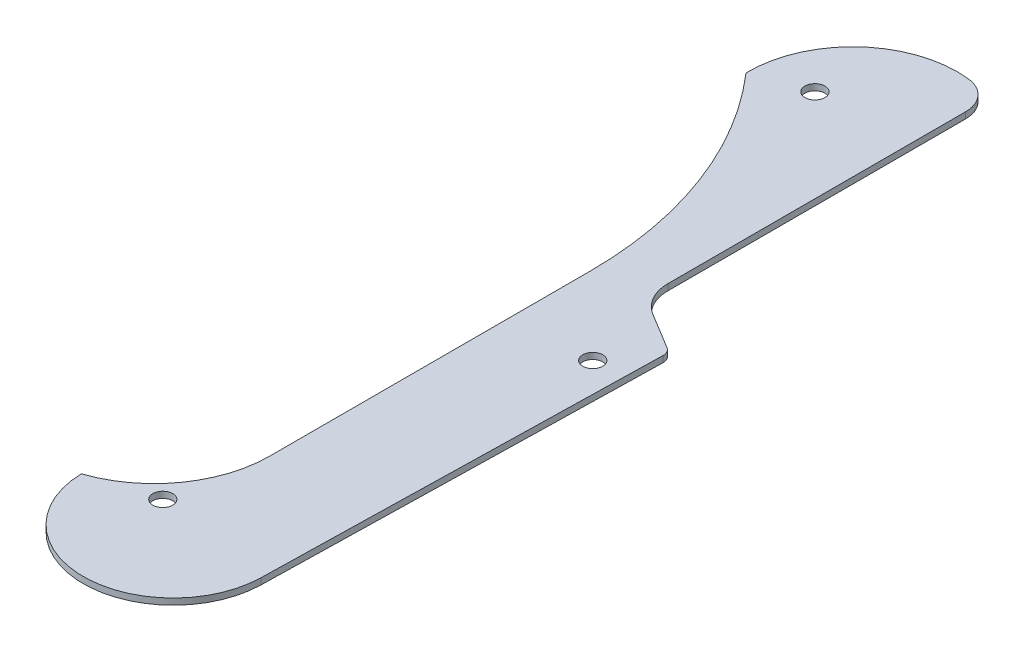
ISO-10303-21;
HEADER;
FILE_DESCRIPTION(('STEP AP214'),'2;1');
FILE_NAME('part.step','',(''),(''),'','','');
FILE_SCHEMA(('AUTOMOTIVE_DESIGN { 1 0 10303 214 1 1 1 1 }'));
ENDSEC;
DATA;
#1=APPLICATION_CONTEXT('core data for automotive mechanical design processes');
#2=APPLICATION_PROTOCOL_DEFINITION('international standard','automotive_design',2000,#1);
#3=PRODUCT_CONTEXT('',#1,'mechanical');
#4=PRODUCT('Part','Part','',(#3));
#5=PRODUCT_RELATED_PRODUCT_CATEGORY('part','',(#4));
#6=PRODUCT_DEFINITION_FORMATION('','',#4);
#7=PRODUCT_DEFINITION_CONTEXT('part definition',#1,'design');
#8=PRODUCT_DEFINITION('design','',#6,#7);
#9=PRODUCT_DEFINITION_SHAPE('','',#8);
#10=(LENGTH_UNIT() NAMED_UNIT(*) SI_UNIT(.MILLI.,.METRE.));
#11=(NAMED_UNIT(*) PLANE_ANGLE_UNIT() SI_UNIT($,.RADIAN.));
#12=(NAMED_UNIT(*) SI_UNIT($,.STERADIAN.) SOLID_ANGLE_UNIT());
#13=UNCERTAINTY_MEASURE_WITH_UNIT(LENGTH_MEASURE(1.E-05),#10,'distance_accuracy_value','');
#14=(GEOMETRIC_REPRESENTATION_CONTEXT(3) GLOBAL_UNCERTAINTY_ASSIGNED_CONTEXT((#13)) GLOBAL_UNIT_ASSIGNED_CONTEXT((#10,
#11,#12)) REPRESENTATION_CONTEXT('',''));
#15=CARTESIAN_POINT('',(0.,0.,0.));
#16=DIRECTION('',(0.,0.,1.));
#17=DIRECTION('',(1.,0.,0.));
#18=AXIS2_PLACEMENT_3D('',#15,#16,#17);
#19=CARTESIAN_POINT('',(0.869342172001299,0.625,-75.4327452585786));
#20=DIRECTION('',(0.,-1.,0.));
#21=DIRECTION('',(0.,0.,-1.));
#22=AXIS2_PLACEMENT_3D('',#19,#20,#21);
#23=CYLINDRICAL_SURFACE('',#22,3.);
#24=DIRECTION('',(0.,-1.,0.));
#25=VECTOR('',#24,1.);
#26=CARTESIAN_POINT('',(3.8693421720013,0.625,-75.4327452585786));
#27=LINE('',#26,#25);
#28=CARTESIAN_POINT('',(3.8693421720013,0.,-75.4327452585786));
#29=VERTEX_POINT('',#28);
#30=CARTESIAN_POINT('',(3.8693421720013,0.625,-75.4327452585786));
#31=VERTEX_POINT('',#30);
#32=EDGE_CURVE('E144',#29,#31,#27,.F.);
#33=ORIENTED_EDGE('',*,*,#32,.F.);
#34=CARTESIAN_POINT('',(0.869342172001299,0.,-75.4327452585786));
#35=DIRECTION('',(0.,-1.,0.));
#36=DIRECTION('',(0.,0.,-1.));
#37=AXIS2_PLACEMENT_3D('',#34,#35,#36);
#38=CIRCLE('',#37,3.);
#39=CARTESIAN_POINT('',(1.21784983835103,0.,-78.4124335655154));
#40=VERTEX_POINT('',#39);
#41=EDGE_CURVE('E45',#40,#29,#38,.T.);
#42=ORIENTED_EDGE('',*,*,#41,.F.);
#43=DIRECTION('',(0.,-1.,0.));
#44=VECTOR('',#43,1.);
#45=CARTESIAN_POINT('',(1.21784983835103,0.625,-78.4124335655154));
#46=LINE('',#45,#44);
#47=CARTESIAN_POINT('',(1.21784983835103,0.625,-78.4124335655154));
#48=VERTEX_POINT('',#47);
#49=EDGE_CURVE('E148',#48,#40,#46,.T.);
#50=ORIENTED_EDGE('',*,*,#49,.F.);
#51=CARTESIAN_POINT('',(0.869342172001299,0.625,-75.4327452585786));
#52=DIRECTION('',(0.,-1.,0.));
#53=DIRECTION('',(0.,0.,-1.));
#54=AXIS2_PLACEMENT_3D('',#51,#52,#53);
#55=CIRCLE('',#54,3.);
#56=EDGE_CURVE('E11',#31,#48,#55,.F.);
#57=ORIENTED_EDGE('',*,*,#56,.F.);
#58=EDGE_LOOP('',(#33,#42,#50,#57));
#59=FACE_BOUND('',#58,.T.);
#60=ADVANCED_FACE('F38',(#59),#23,.T.);
#61=CARTESIAN_POINT('',(0.,0.625,0.));
#62=DIRECTION('',(0.,-1.,0.));
#63=DIRECTION('',(0.,0.,-1.));
#64=AXIS2_PLACEMENT_3D('',#61,#62,#63);
#65=PLANE('',#64);
#66=CARTESIAN_POINT('',(-5.3990700013326,0.625,-69.6166137620408));
#67=DIRECTION('',(0.,-1.,0.));
#68=DIRECTION('',(0.,0.,-1.));
#69=AXIS2_PLACEMENT_3D('',#66,#67,#68);
#70=CIRCLE('',#69,0.999999999999998);
#71=CARTESIAN_POINT('',(-5.3990700013326,0.625,-70.6166137620408));
#72=VERTEX_POINT('',#71);
#73=EDGE_CURVE('E138',#72,#72,#70,.F.);
#74=ORIENTED_EDGE('',*,*,#73,.F.);
#75=EDGE_LOOP('',(#74));
#76=FACE_BOUND('',#75,.T.);
#77=CARTESIAN_POINT('',(6.76984482044387,0.625,-35.2160361829315));
#78=DIRECTION('',(0.,-1.,0.));
#79=DIRECTION('',(0.,0.,-1.));
#80=AXIS2_PLACEMENT_3D('',#77,#78,#79);
#81=CIRCLE('',#80,0.999999999999999);
#82=CARTESIAN_POINT('',(6.76984482044387,0.625,-36.2160361829315));
#83=VERTEX_POINT('',#82);
#84=EDGE_CURVE('E268',#83,#83,#81,.F.);
#85=ORIENTED_EDGE('',*,*,#84,.F.);
#86=EDGE_LOOP('',(#85));
#87=FACE_BOUND('',#86,.T.);
#88=CARTESIAN_POINT('',(-2.70506215575308,0.625,-1.67));
#89=DIRECTION('',(0.,-1.,0.));
#90=DIRECTION('',(0.,0.,-1.));
#91=AXIS2_PLACEMENT_3D('',#88,#89,#90);
#92=CIRCLE('',#91,1.);
#93=CARTESIAN_POINT('',(-2.70506215575308,0.625,-2.67));
#94=VERTEX_POINT('',#93);
#95=EDGE_CURVE('E218',#94,#94,#92,.F.);
#96=ORIENTED_EDGE('',*,*,#95,.F.);
#97=EDGE_LOOP('',(#96));
#98=FACE_BOUND('',#97,.T.);
#99=DIRECTION('',(0.,0.,-1.));
#100=VECTOR('',#99,1.);
#101=CARTESIAN_POINT('',(3.8693421720013,0.625,-45.6356836656231));
#102=LINE('',#101,#100);
#103=CARTESIAN_POINT('',(3.8693421720013,0.625,-45.6356836656231));
#104=VERTEX_POINT('',#103);
#105=EDGE_CURVE('E164',#104,#31,#102,.T.);
#106=ORIENTED_EDGE('',*,*,#105,.T.);
#107=ORIENTED_EDGE('',*,*,#56,.T.);
#108=CARTESIAN_POINT('',(0.,0.625,-68.));
#109=DIRECTION('',(0.,1.,0.));
#110=DIRECTION('',(0.,0.,1.));
#111=AXIS2_PLACEMENT_3D('',#108,#109,#110);
#112=CIRCLE('',#111,10.4834121823499);
#113=CARTESIAN_POINT('',(-10.4815735440394,0.625,-67.803666034689));
#114=VERTEX_POINT('',#113);
#115=EDGE_CURVE('E161',#48,#114,#112,.T.);
#116=ORIENTED_EDGE('',*,*,#115,.T.);
#117=CARTESIAN_POINT('',(-39.1042620139909,0.625,-42.8088324734886));
#118=DIRECTION('',(0.,1.,0.));
#119=DIRECTION('',(0.,0.,-1.));
#120=AXIS2_PLACEMENT_3D('',#117,#118,#119);
#121=CIRCLE('',#120,38.);
#122=CARTESIAN_POINT('',(-1.10426201399089,0.625,-42.8088324734886));
#123=VERTEX_POINT('',#122);
#124=EDGE_CURVE('E150',#123,#114,#121,.T.);
#125=ORIENTED_EDGE('',*,*,#124,.F.);
#126=DIRECTION('',(0.,0.,-1.));
#127=VECTOR('',#126,1.);
#128=CARTESIAN_POINT('',(-1.10426201399089,0.625,-42.8088324734886));
#129=LINE('',#128,#127);
#130=CARTESIAN_POINT('',(-1.10426201399088,0.625,-10.8088324734886));
#131=VERTEX_POINT('',#130);
#132=EDGE_CURVE('E143',#131,#123,#129,.T.);
#133=ORIENTED_EDGE('',*,*,#132,.F.);
#134=CARTESIAN_POINT('',(-12.7227021042548,0.625,-10.8088324734886));
#135=DIRECTION('',(0.,1.,0.));
#136=DIRECTION('',(0.,0.,-1.));
#137=AXIS2_PLACEMENT_3D('',#134,#135,#136);
#138=CIRCLE('',#137,11.6184400902639);
#139=CARTESIAN_POINT('',(-8.99785824371918,0.625,0.196333965311016));
#140=VERTEX_POINT('',#139);
#141=EDGE_CURVE('E121',#140,#131,#138,.T.);
#142=ORIENTED_EDGE('',*,*,#141,.F.);
#143=CARTESIAN_POINT('',(0.,0.625,0.));
#144=DIRECTION('',(0.,1.,0.));
#145=DIRECTION('',(0.,0.,-1.));
#146=AXIS2_PLACEMENT_3D('',#143,#144,#145);
#147=CIRCLE('',#146,9.);
#148=CARTESIAN_POINT('',(8.99785824371918,0.625,0.196333965311016));
#149=VERTEX_POINT('',#148);
#150=EDGE_CURVE('E133',#140,#149,#147,.T.);
#151=ORIENTED_EDGE('',*,*,#150,.T.);
#152=DIRECTION('',(0.0218148850345573,0.,-0.999762027079909));
#153=VECTOR('',#152,1.);
#154=CARTESIAN_POINT('',(8.99785824371918,0.625,0.196333965311016));
#155=LINE('',#154,#153);
#156=CARTESIAN_POINT('',(9.85674734225426,0.625,-39.1659961513962));
#157=VERTEX_POINT('',#156);
#158=EDGE_CURVE('E137',#149,#157,#155,.T.);
#159=ORIENTED_EDGE('',*,*,#158,.T.);
#160=CARTESIAN_POINT('',(8.85698531517435,0.625,-39.1878110364307));
#161=DIRECTION('',(0.,1.,0.));
#162=DIRECTION('',(0.,0.,1.));
#163=AXIS2_PLACEMENT_3D('',#160,#161,#162);
#164=CIRCLE('',#163,0.999999999999999);
#165=CARTESIAN_POINT('',(9.37575857333486,0.625,-40.0427229071037));
#166=VERTEX_POINT('',#165);
#167=EDGE_CURVE('E202',#157,#166,#164,.T.);
#168=ORIENTED_EDGE('',*,*,#167,.T.);
#169=DIRECTION('',(-0.85491187067295,0.,-0.518773258160516));
#170=VECTOR('',#169,1.);
#171=CARTESIAN_POINT('',(9.37575857333486,0.625,-40.0427229071037));
#172=LINE('',#171,#170);
#173=CARTESIAN_POINT('',(5.79424913935925,0.625,-42.2160361829313));
#174=VERTEX_POINT('',#173);
#175=EDGE_CURVE('E200',#166,#174,#172,.T.);
#176=ORIENTED_EDGE('',*,*,#175,.T.);
#177=CARTESIAN_POINT('',(7.8693421720013,0.625,-45.6356836656231));
#178=DIRECTION('',(0.,-1.,0.));
#179=DIRECTION('',(0.,0.,-1.));
#180=AXIS2_PLACEMENT_3D('',#177,#178,#179);
#181=CIRCLE('',#180,4.);
#182=EDGE_CURVE('E198',#174,#104,#181,.T.);
#183=ORIENTED_EDGE('',*,*,#182,.T.);
#184=EDGE_LOOP('',(#106,#107,#116,#125,#133,#142,#151,#159,#168,#176,#183));
#185=FACE_BOUND('',#184,.T.);
#186=ADVANCED_FACE('F140',(#76,#87,#98,#185),#65,.F.);
#187=CARTESIAN_POINT('',(0.,0.,0.));
#188=DIRECTION('',(0.,-1.,0.));
#189=DIRECTION('',(0.,0.,-1.));
#190=AXIS2_PLACEMENT_3D('',#187,#188,#189);
#191=PLANE('',#190);
#192=CARTESIAN_POINT('',(-5.3990700013326,0.,-69.6166137620408));
#193=DIRECTION('',(0.,-1.,0.));
#194=DIRECTION('',(0.,0.,-1.));
#195=AXIS2_PLACEMENT_3D('',#192,#193,#194);
#196=CIRCLE('',#195,0.999999999999998);
#197=CARTESIAN_POINT('',(-5.3990700013326,0.,-70.6166137620408));
#198=VERTEX_POINT('',#197);
#199=EDGE_CURVE('E280',#198,#198,#196,.T.);
#200=ORIENTED_EDGE('',*,*,#199,.F.);
#201=EDGE_LOOP('',(#200));
#202=FACE_BOUND('',#201,.T.);
#203=CARTESIAN_POINT('',(6.76984482044387,0.,-35.2160361829315));
#204=DIRECTION('',(0.,-1.,0.));
#205=DIRECTION('',(0.,0.,-1.));
#206=AXIS2_PLACEMENT_3D('',#203,#204,#205);
#207=CIRCLE('',#206,0.999999999999999);
#208=CARTESIAN_POINT('',(6.76984482044387,0.,-36.2160361829315));
#209=VERTEX_POINT('',#208);
#210=EDGE_CURVE('E272',#209,#209,#207,.T.);
#211=ORIENTED_EDGE('',*,*,#210,.F.);
#212=EDGE_LOOP('',(#211));
#213=FACE_BOUND('',#212,.T.);
#214=CARTESIAN_POINT('',(-2.70506215575308,0.,-1.67));
#215=DIRECTION('',(0.,-1.,0.));
#216=DIRECTION('',(0.,0.,-1.));
#217=AXIS2_PLACEMENT_3D('',#214,#215,#216);
#218=CIRCLE('',#217,1.);
#219=CARTESIAN_POINT('',(-2.70506215575308,0.,-2.67));
#220=VERTEX_POINT('',#219);
#221=EDGE_CURVE('E273',#220,#220,#218,.T.);
#222=ORIENTED_EDGE('',*,*,#221,.F.);
#223=EDGE_LOOP('',(#222));
#224=FACE_BOUND('',#223,.T.);
#225=CARTESIAN_POINT('',(0.,0.,-68.));
#226=DIRECTION('',(0.,1.,0.));
#227=DIRECTION('',(0.,0.,1.));
#228=AXIS2_PLACEMENT_3D('',#225,#226,#227);
#229=CIRCLE('',#228,10.4834121823499);
#230=CARTESIAN_POINT('',(-10.4815735440394,0.,-67.803666034689));
#231=VERTEX_POINT('',#230);
#232=EDGE_CURVE('E165',#40,#231,#229,.T.);
#233=ORIENTED_EDGE('',*,*,#232,.F.);
#234=ORIENTED_EDGE('',*,*,#41,.T.);
#235=DIRECTION('',(0.,0.,-1.));
#236=VECTOR('',#235,1.);
#237=CARTESIAN_POINT('',(3.8693421720013,0.,-45.6356836656231));
#238=LINE('',#237,#236);
#239=CARTESIAN_POINT('',(3.8693421720013,0.,-45.6356836656231));
#240=VERTEX_POINT('',#239);
#241=EDGE_CURVE('E175',#240,#29,#238,.T.);
#242=ORIENTED_EDGE('',*,*,#241,.F.);
#243=CARTESIAN_POINT('',(7.8693421720013,0.,-45.6356836656231));
#244=DIRECTION('',(0.,-1.,0.));
#245=DIRECTION('',(0.,0.,-1.));
#246=AXIS2_PLACEMENT_3D('',#243,#244,#245);
#247=CIRCLE('',#246,4.);
#248=CARTESIAN_POINT('',(5.79424913935925,0.,-42.2160361829313));
#249=VERTEX_POINT('',#248);
#250=EDGE_CURVE('E185',#249,#240,#247,.T.);
#251=ORIENTED_EDGE('',*,*,#250,.F.);
#252=DIRECTION('',(-0.85491187067295,0.,-0.518773258160516));
#253=VECTOR('',#252,1.);
#254=CARTESIAN_POINT('',(9.37575857333486,0.,-40.0427229071037));
#255=LINE('',#254,#253);
#256=CARTESIAN_POINT('',(9.37575857333486,0.,-40.0427229071037));
#257=VERTEX_POINT('',#256);
#258=EDGE_CURVE('E190',#257,#249,#255,.T.);
#259=ORIENTED_EDGE('',*,*,#258,.F.);
#260=CARTESIAN_POINT('',(8.85698531517435,0.,-39.1878110364307));
#261=DIRECTION('',(0.,1.,0.));
#262=DIRECTION('',(0.,0.,1.));
#263=AXIS2_PLACEMENT_3D('',#260,#261,#262);
#264=CIRCLE('',#263,0.999999999999999);
#265=CARTESIAN_POINT('',(9.85674734225426,0.,-39.1659961513962));
#266=VERTEX_POINT('',#265);
#267=EDGE_CURVE('E193',#266,#257,#264,.T.);
#268=ORIENTED_EDGE('',*,*,#267,.F.);
#269=DIRECTION('',(0.0218148850345573,0.,-0.999762027079909));
#270=VECTOR('',#269,1.);
#271=CARTESIAN_POINT('',(8.99785824371918,0.,0.196333965311016));
#272=LINE('',#271,#270);
#273=CARTESIAN_POINT('',(8.99785824371918,0.,0.196333965311016));
#274=VERTEX_POINT('',#273);
#275=EDGE_CURVE('E128',#274,#266,#272,.T.);
#276=ORIENTED_EDGE('',*,*,#275,.F.);
#277=CARTESIAN_POINT('',(0.,0.,0.));
#278=DIRECTION('',(0.,1.,0.));
#279=DIRECTION('',(0.,0.,-1.));
#280=AXIS2_PLACEMENT_3D('',#277,#278,#279);
#281=CIRCLE('',#280,9.);
#282=CARTESIAN_POINT('',(-8.99785824371918,0.,0.196333965311016));
#283=VERTEX_POINT('',#282);
#284=EDGE_CURVE('E129',#283,#274,#281,.T.);
#285=ORIENTED_EDGE('',*,*,#284,.F.);
#286=CARTESIAN_POINT('',(-12.7227021042548,0.,-10.8088324734886));
#287=DIRECTION('',(0.,1.,0.));
#288=DIRECTION('',(0.,0.,-1.));
#289=AXIS2_PLACEMENT_3D('',#286,#287,#288);
#290=CIRCLE('',#289,11.6184400902639);
#291=CARTESIAN_POINT('',(-1.10426201399088,0.,-10.8088324734886));
#292=VERTEX_POINT('',#291);
#293=EDGE_CURVE('E124',#283,#292,#290,.T.);
#294=ORIENTED_EDGE('',*,*,#293,.T.);
#295=DIRECTION('',(0.,0.,-1.));
#296=VECTOR('',#295,1.);
#297=CARTESIAN_POINT('',(-1.10426201399089,0.,-42.8088324734886));
#298=LINE('',#297,#296);
#299=CARTESIAN_POINT('',(-1.10426201399089,0.,-42.8088324734886));
#300=VERTEX_POINT('',#299);
#301=EDGE_CURVE('E158',#292,#300,#298,.T.);
#302=ORIENTED_EDGE('',*,*,#301,.T.);
#303=CARTESIAN_POINT('',(-39.1042620139909,0.,-42.8088324734886));
#304=DIRECTION('',(0.,1.,0.));
#305=DIRECTION('',(0.,0.,-1.));
#306=AXIS2_PLACEMENT_3D('',#303,#304,#305);
#307=CIRCLE('',#306,38.);
#308=EDGE_CURVE('E155',#300,#231,#307,.T.);
#309=ORIENTED_EDGE('',*,*,#308,.T.);
#310=EDGE_LOOP('',(#233,#234,#242,#251,#259,#268,#276,#285,#294,#302,#309));
#311=FACE_BOUND('',#310,.T.);
#312=ADVANCED_FACE('F172',(#202,#213,#224,#311),#191,.T.);
#313=CARTESIAN_POINT('',(0.,0.625,0.));
#314=DIRECTION('',(0.,-1.,0.));
#315=DIRECTION('',(0.,0.,-1.));
#316=AXIS2_PLACEMENT_3D('',#313,#314,#315);
#317=CYLINDRICAL_SURFACE('',#316,9.);
#318=ORIENTED_EDGE('',*,*,#284,.T.);
#319=DIRECTION('',(0.,-1.,0.));
#320=VECTOR('',#319,1.);
#321=CARTESIAN_POINT('',(8.99785824371918,0.625,0.196333965311016));
#322=LINE('',#321,#320);
#323=EDGE_CURVE('E136',#149,#274,#322,.T.);
#324=ORIENTED_EDGE('',*,*,#323,.F.);
#325=ORIENTED_EDGE('',*,*,#150,.F.);
#326=DIRECTION('',(0.,-1.,0.));
#327=VECTOR('',#326,1.);
#328=CARTESIAN_POINT('',(-8.99785824371918,0.625,0.196333965311016));
#329=LINE('',#328,#327);
#330=EDGE_CURVE('E117',#140,#283,#329,.T.);
#331=ORIENTED_EDGE('',*,*,#330,.T.);
#332=EDGE_LOOP('',(#318,#324,#325,#331));
#333=FACE_BOUND('',#332,.T.);
#334=ADVANCED_FACE('F134',(#333),#317,.T.);
#335=CARTESIAN_POINT('',(8.99785824371918,0.625,0.196333965311016));
#336=DIRECTION('',(-0.999762027079909,0.,-0.0218148850345573));
#337=DIRECTION('',(-0.0218148850345573,0.,0.999762027079909));
#338=AXIS2_PLACEMENT_3D('',#335,#336,#337);
#339=PLANE('',#338);
#340=ORIENTED_EDGE('',*,*,#275,.T.);
#341=DIRECTION('',(0.,-1.,0.));
#342=VECTOR('',#341,1.);
#343=CARTESIAN_POINT('',(9.85674734225426,0.625,-39.1659961513962));
#344=LINE('',#343,#342);
#345=EDGE_CURVE('E192',#157,#266,#344,.T.);
#346=ORIENTED_EDGE('',*,*,#345,.F.);
#347=ORIENTED_EDGE('',*,*,#158,.F.);
#348=ORIENTED_EDGE('',*,*,#323,.T.);
#349=EDGE_LOOP('',(#340,#346,#347,#348));
#350=FACE_BOUND('',#349,.T.);
#351=ADVANCED_FACE('F239',(#350),#339,.F.);
#352=CARTESIAN_POINT('',(8.85698531517435,0.625,-39.1878110364307));
#353=DIRECTION('',(0.,-1.,0.));
#354=DIRECTION('',(0.,0.,-1.));
#355=AXIS2_PLACEMENT_3D('',#352,#353,#354);
#356=CYLINDRICAL_SURFACE('',#355,0.999999999999999);
#357=ORIENTED_EDGE('',*,*,#267,.T.);
#358=DIRECTION('',(0.,-1.,0.));
#359=VECTOR('',#358,1.);
#360=CARTESIAN_POINT('',(9.37575857333486,0.625,-40.0427229071037));
#361=LINE('',#360,#359);
#362=EDGE_CURVE('E189',#166,#257,#361,.T.);
#363=ORIENTED_EDGE('',*,*,#362,.F.);
#364=ORIENTED_EDGE('',*,*,#167,.F.);
#365=ORIENTED_EDGE('',*,*,#345,.T.);
#366=EDGE_LOOP('',(#357,#363,#364,#365));
#367=FACE_BOUND('',#366,.T.);
#368=ADVANCED_FACE('F237',(#367),#356,.T.);
#369=CARTESIAN_POINT('',(9.37575857333486,0.625,-40.0427229071037));
#370=DIRECTION('',(-0.518773258160516,0.,0.85491187067295));
#371=DIRECTION('',(0.85491187067295,0.,0.518773258160516));
#372=AXIS2_PLACEMENT_3D('',#369,#370,#371);
#373=PLANE('',#372);
#374=ORIENTED_EDGE('',*,*,#258,.T.);
#375=DIRECTION('',(0.,-1.,0.));
#376=VECTOR('',#375,1.);
#377=CARTESIAN_POINT('',(5.79424913935925,0.625,-42.2160361829313));
#378=LINE('',#377,#376);
#379=EDGE_CURVE('E181',#174,#249,#378,.T.);
#380=ORIENTED_EDGE('',*,*,#379,.F.);
#381=ORIENTED_EDGE('',*,*,#175,.F.);
#382=ORIENTED_EDGE('',*,*,#362,.T.);
#383=EDGE_LOOP('',(#374,#380,#381,#382));
#384=FACE_BOUND('',#383,.T.);
#385=ADVANCED_FACE('F228',(#384),#373,.F.);
#386=CARTESIAN_POINT('',(7.8693421720013,0.625,-45.6356836656231));
#387=DIRECTION('',(0.,-1.,0.));
#388=DIRECTION('',(0.,0.,-1.));
#389=AXIS2_PLACEMENT_3D('',#386,#387,#388);
#390=CYLINDRICAL_SURFACE('',#389,4.);
#391=ORIENTED_EDGE('',*,*,#250,.T.);
#392=DIRECTION('',(0.,-1.,0.));
#393=VECTOR('',#392,1.);
#394=CARTESIAN_POINT('',(3.8693421720013,0.625,-45.6356836656231));
#395=LINE('',#394,#393);
#396=EDGE_CURVE('E167',#104,#240,#395,.T.);
#397=ORIENTED_EDGE('',*,*,#396,.F.);
#398=ORIENTED_EDGE('',*,*,#182,.F.);
#399=ORIENTED_EDGE('',*,*,#379,.T.);
#400=EDGE_LOOP('',(#391,#397,#398,#399));
#401=FACE_BOUND('',#400,.T.);
#402=ADVANCED_FACE('F234',(#401),#390,.F.);
#403=CARTESIAN_POINT('',(3.8693421720013,0.625,-45.6356836656231));
#404=DIRECTION('',(-1.,0.,0.));
#405=DIRECTION('',(0.,0.,1.));
#406=AXIS2_PLACEMENT_3D('',#403,#404,#405);
#407=PLANE('',#406);
#408=ORIENTED_EDGE('',*,*,#241,.T.);
#409=ORIENTED_EDGE('',*,*,#32,.T.);
#410=ORIENTED_EDGE('',*,*,#105,.F.);
#411=ORIENTED_EDGE('',*,*,#396,.T.);
#412=EDGE_LOOP('',(#408,#409,#410,#411));
#413=FACE_BOUND('',#412,.T.);
#414=ADVANCED_FACE('F179',(#413),#407,.F.);
#415=CARTESIAN_POINT('',(0.,0.625,-68.));
#416=DIRECTION('',(0.,-1.,0.));
#417=DIRECTION('',(0.,0.,-1.));
#418=AXIS2_PLACEMENT_3D('',#415,#416,#417);
#419=CYLINDRICAL_SURFACE('',#418,10.4834121823499);
#420=ORIENTED_EDGE('',*,*,#115,.F.);
#421=ORIENTED_EDGE('',*,*,#49,.T.);
#422=ORIENTED_EDGE('',*,*,#232,.T.);
#423=DIRECTION('',(0.,1.,0.));
#424=VECTOR('',#423,1.);
#425=CARTESIAN_POINT('',(-10.4815735440394,0.3125,-67.803666034689));
#426=LINE('',#425,#424);
#427=EDGE_CURVE('E166',#231,#114,#426,.T.);
#428=ORIENTED_EDGE('',*,*,#427,.T.);
#429=EDGE_LOOP('',(#420,#421,#422,#428));
#430=FACE_BOUND('',#429,.T.);
#431=ADVANCED_FACE('F214',(#430),#419,.T.);
#432=CARTESIAN_POINT('',(-1.10426201399089,0.,-42.8088324734886));
#433=DIRECTION('',(1.,0.,0.));
#434=DIRECTION('',(0.,0.,-1.));
#435=AXIS2_PLACEMENT_3D('',#432,#433,#434);
#436=PLANE('',#435);
#437=ORIENTED_EDGE('',*,*,#132,.T.);
#438=DIRECTION('',(0.,1.,0.));
#439=VECTOR('',#438,1.);
#440=CARTESIAN_POINT('',(-1.10426201399089,0.,-42.8088324734886));
#441=LINE('',#440,#439);
#442=EDGE_CURVE('E145',#300,#123,#441,.T.);
#443=ORIENTED_EDGE('',*,*,#442,.F.);
#444=ORIENTED_EDGE('',*,*,#301,.F.);
#445=DIRECTION('',(0.,1.,0.));
#446=VECTOR('',#445,1.);
#447=CARTESIAN_POINT('',(-1.10426201399088,0.,-10.8088324734886));
#448=LINE('',#447,#446);
#449=EDGE_CURVE('E205',#292,#131,#448,.T.);
#450=ORIENTED_EDGE('',*,*,#449,.T.);
#451=EDGE_LOOP('',(#437,#443,#444,#450));
#452=FACE_BOUND('',#451,.T.);
#453=ADVANCED_FACE('F242',(#452),#436,.F.);
#454=CARTESIAN_POINT('',(-39.1042620139909,0.,-42.8088324734886));
#455=DIRECTION('',(0.,1.,0.));
#456=DIRECTION('',(0.,0.,1.));
#457=AXIS2_PLACEMENT_3D('',#454,#455,#456);
#458=CYLINDRICAL_SURFACE('',#457,38.);
#459=ORIENTED_EDGE('',*,*,#124,.T.);
#460=ORIENTED_EDGE('',*,*,#427,.F.);
#461=ORIENTED_EDGE('',*,*,#308,.F.);
#462=ORIENTED_EDGE('',*,*,#442,.T.);
#463=EDGE_LOOP('',(#459,#460,#461,#462));
#464=FACE_BOUND('',#463,.T.);
#465=ADVANCED_FACE('F210',(#464),#458,.F.);
#466=CARTESIAN_POINT('',(-12.7227021042548,0.,-10.8088324734886));
#467=DIRECTION('',(0.,1.,0.));
#468=DIRECTION('',(0.,0.,1.));
#469=AXIS2_PLACEMENT_3D('',#466,#467,#468);
#470=CYLINDRICAL_SURFACE('',#469,11.6184400902639);
#471=ORIENTED_EDGE('',*,*,#141,.T.);
#472=ORIENTED_EDGE('',*,*,#449,.F.);
#473=ORIENTED_EDGE('',*,*,#293,.F.);
#474=ORIENTED_EDGE('',*,*,#330,.F.);
#475=EDGE_LOOP('',(#471,#472,#473,#474));
#476=FACE_BOUND('',#475,.T.);
#477=ADVANCED_FACE('F119',(#476),#470,.F.);
#478=CARTESIAN_POINT('',(-2.70506215575308,0.626,-1.67));
#479=DIRECTION('',(0.,-1.,0.));
#480=DIRECTION('',(0.,0.,-1.));
#481=AXIS2_PLACEMENT_3D('',#478,#479,#480);
#482=CYLINDRICAL_SURFACE('',#481,1.);
#483=CARTESIAN_POINT('',(-2.70506215575308,0.,-2.67));
#484=CARTESIAN_POINT('',(-2.70506215575308,0.00651041666666678,-2.67));
#485=CARTESIAN_POINT('',(-2.70506215575308,0.0130208333333335,-2.67));
#486=CARTESIAN_POINT('',(-2.70506215575308,0.0260416666666668,-2.67));
#487=CARTESIAN_POINT('',(-2.70506215575308,0.0325520833333335,-2.67));
#488=CARTESIAN_POINT('',(-2.70506215575308,0.0455729166666668,-2.67));
#489=CARTESIAN_POINT('',(-2.70506215575308,0.0520833333333335,-2.67));
#490=CARTESIAN_POINT('',(-2.70506215575308,0.0651041666666668,-2.67));
#491=CARTESIAN_POINT('',(-2.70506215575308,0.0716145833333334,-2.67));
#492=CARTESIAN_POINT('',(-2.70506215575308,0.0846354166666667,-2.67));
#493=CARTESIAN_POINT('',(-2.70506215575308,0.0911458333333334,-2.67));
#494=CARTESIAN_POINT('',(-2.70506215575308,0.104166666666667,-2.67));
#495=CARTESIAN_POINT('',(-2.70506215575308,0.110677083333333,-2.67));
#496=CARTESIAN_POINT('',(-2.70506215575308,0.123697916666667,-2.67));
#497=CARTESIAN_POINT('',(-2.70506215575308,0.130208333333333,-2.67));
#498=CARTESIAN_POINT('',(-2.70506215575308,0.143229166666667,-2.67));
#499=CARTESIAN_POINT('',(-2.70506215575308,0.149739583333333,-2.67));
#500=CARTESIAN_POINT('',(-2.70506215575308,0.162760416666667,-2.67));
#501=CARTESIAN_POINT('',(-2.70506215575308,0.169270833333333,-2.67));
#502=CARTESIAN_POINT('',(-2.70506215575308,0.182291666666667,-2.67));
#503=CARTESIAN_POINT('',(-2.70506215575308,0.188802083333333,-2.67));
#504=CARTESIAN_POINT('',(-2.70506215575308,0.201822916666667,-2.67));
#505=CARTESIAN_POINT('',(-2.70506215575308,0.208333333333333,-2.67));
#506=CARTESIAN_POINT('',(-2.70506215575308,0.221354166666667,-2.67));
#507=CARTESIAN_POINT('',(-2.70506215575308,0.227864583333333,-2.67));
#508=CARTESIAN_POINT('',(-2.70506215575308,0.240885416666667,-2.67));
#509=CARTESIAN_POINT('',(-2.70506215575308,0.247395833333333,-2.67));
#510=CARTESIAN_POINT('',(-2.70506215575308,0.260416666666667,-2.67));
#511=CARTESIAN_POINT('',(-2.70506215575308,0.266927083333333,-2.67));
#512=CARTESIAN_POINT('',(-2.70506215575308,0.279947916666667,-2.67));
#513=CARTESIAN_POINT('',(-2.70506215575308,0.286458333333333,-2.67));
#514=CARTESIAN_POINT('',(-2.70506215575308,0.299479166666667,-2.67));
#515=CARTESIAN_POINT('',(-2.70506215575308,0.305989583333333,-2.67));
#516=CARTESIAN_POINT('',(-2.70506215575308,0.319010416666667,-2.67));
#517=CARTESIAN_POINT('',(-2.70506215575308,0.325520833333333,-2.67));
#518=CARTESIAN_POINT('',(-2.70506215575308,0.338541666666667,-2.67));
#519=CARTESIAN_POINT('',(-2.70506215575308,0.345052083333333,-2.67));
#520=CARTESIAN_POINT('',(-2.70506215575308,0.358072916666667,-2.67));
#521=CARTESIAN_POINT('',(-2.70506215575308,0.364583333333333,-2.67));
#522=CARTESIAN_POINT('',(-2.70506215575308,0.377604166666667,-2.67));
#523=CARTESIAN_POINT('',(-2.70506215575308,0.384114583333333,-2.67));
#524=CARTESIAN_POINT('',(-2.70506215575308,0.397135416666667,-2.67));
#525=CARTESIAN_POINT('',(-2.70506215575308,0.403645833333333,-2.67));
#526=CARTESIAN_POINT('',(-2.70506215575308,0.416666666666667,-2.67));
#527=CARTESIAN_POINT('',(-2.70506215575308,0.423177083333333,-2.67));
#528=CARTESIAN_POINT('',(-2.70506215575308,0.436197916666667,-2.67));
#529=CARTESIAN_POINT('',(-2.70506215575308,0.442708333333333,-2.67));
#530=CARTESIAN_POINT('',(-2.70506215575308,0.455729166666667,-2.67));
#531=CARTESIAN_POINT('',(-2.70506215575308,0.462239583333333,-2.67));
#532=CARTESIAN_POINT('',(-2.70506215575308,0.475260416666667,-2.67));
#533=CARTESIAN_POINT('',(-2.70506215575308,0.481770833333333,-2.67));
#534=CARTESIAN_POINT('',(-2.70506215575308,0.494791666666667,-2.67));
#535=CARTESIAN_POINT('',(-2.70506215575308,0.501302083333333,-2.67));
#536=CARTESIAN_POINT('',(-2.70506215575308,0.514322916666667,-2.67));
#537=CARTESIAN_POINT('',(-2.70506215575308,0.520833333333333,-2.67));
#538=CARTESIAN_POINT('',(-2.70506215575308,0.533854166666667,-2.67));
#539=CARTESIAN_POINT('',(-2.70506215575308,0.540364583333333,-2.67));
#540=CARTESIAN_POINT('',(-2.70506215575308,0.553385416666667,-2.67));
#541=CARTESIAN_POINT('',(-2.70506215575308,0.559895833333333,-2.67));
#542=CARTESIAN_POINT('',(-2.70506215575308,0.572916666666667,-2.67));
#543=CARTESIAN_POINT('',(-2.70506215575308,0.579427083333333,-2.67));
#544=CARTESIAN_POINT('',(-2.70506215575308,0.592447916666667,-2.67));
#545=CARTESIAN_POINT('',(-2.70506215575308,0.598958333333333,-2.67));
#546=CARTESIAN_POINT('',(-2.70506215575308,0.611979166666667,-2.67));
#547=CARTESIAN_POINT('',(-2.70506215575308,0.618489583333333,-2.67));
#548=CARTESIAN_POINT('',(-2.70506215575308,0.625,-2.67));
#549=B_SPLINE_CURVE_WITH_KNOTS('',3,(#483,#484,#485,#486,#487,#488,#489,#490,#491,#492,#493,
#494,#495,#496,#497,#498,#499,#500,#501,#502,#503,#504,#505,#506,#507,#508,#509,#510,#511,#512,
#513,#514,#515,#516,#517,#518,#519,#520,#521,#522,#523,#524,#525,#526,#527,#528,#529,#530,#531,
#532,#533,#534,#535,#536,#537,#538,#539,#540,#541,#542,#543,#544,#545,#546,#547,#548),
.UNSPECIFIED.,.F.,.F.,(4,2,2,2,2,2,2,2,2,2,2,2,2,2,2,2,2,2,2,2,2,2,2,2,2,2,2,2,2,2,2,2,4),(0.,
0.01953125,0.0390625,0.0585937500000001,0.078125,0.09765625,0.1171875,0.13671875,0.15625,
0.17578125,0.1953125,0.21484375,0.234375,0.25390625,0.2734375,0.29296875,0.3125,0.33203125,
0.3515625,0.37109375,0.390625,0.41015625,0.4296875,0.44921875,0.46875,0.48828125,0.5078125,
0.52734375,0.546875,0.56640625,0.5859375,0.60546875,0.625),.UNSPECIFIED.);
#550=EDGE_CURVE('BSEAM295',#220,#94,#549,.T.);
#551=ORIENTED_EDGE('',*,*,#221,.T.);
#552=ORIENTED_EDGE('',*,*,#95,.T.);
#553=ORIENTED_EDGE('',*,*,#550,.T.);
#554=ORIENTED_EDGE('',*,*,#550,.F.);
#555=EDGE_LOOP('',(#551,#553,#552,#554));
#556=FACE_BOUND('',#555,.T.);
#557=ADVANCED_FACE('F295',(#556),#482,.F.);
#558=CARTESIAN_POINT('',(6.76984482044387,0.626,-35.2160361829315));
#559=DIRECTION('',(0.,-1.,0.));
#560=DIRECTION('',(0.,0.,-1.));
#561=AXIS2_PLACEMENT_3D('',#558,#559,#560);
#562=CYLINDRICAL_SURFACE('',#561,0.999999999999999);
#563=CARTESIAN_POINT('',(6.76984482044387,0.,-36.2160361829315));
#564=CARTESIAN_POINT('',(6.76984482044387,0.00651041666666678,-36.2160361829315));
#565=CARTESIAN_POINT('',(6.76984482044387,0.0130208333333335,-36.2160361829315));
#566=CARTESIAN_POINT('',(6.76984482044387,0.0260416666666668,-36.2160361829315));
#567=CARTESIAN_POINT('',(6.76984482044387,0.0325520833333335,-36.2160361829315));
#568=CARTESIAN_POINT('',(6.76984482044387,0.0455729166666668,-36.2160361829315));
#569=CARTESIAN_POINT('',(6.76984482044387,0.0520833333333335,-36.2160361829315));
#570=CARTESIAN_POINT('',(6.76984482044387,0.0651041666666668,-36.2160361829315));
#571=CARTESIAN_POINT('',(6.76984482044387,0.0716145833333334,-36.2160361829315));
#572=CARTESIAN_POINT('',(6.76984482044387,0.0846354166666667,-36.2160361829315));
#573=CARTESIAN_POINT('',(6.76984482044387,0.0911458333333334,-36.2160361829315));
#574=CARTESIAN_POINT('',(6.76984482044387,0.104166666666667,-36.2160361829315));
#575=CARTESIAN_POINT('',(6.76984482044387,0.110677083333333,-36.2160361829315));
#576=CARTESIAN_POINT('',(6.76984482044387,0.123697916666667,-36.2160361829315));
#577=CARTESIAN_POINT('',(6.76984482044387,0.130208333333333,-36.2160361829315));
#578=CARTESIAN_POINT('',(6.76984482044387,0.143229166666667,-36.2160361829315));
#579=CARTESIAN_POINT('',(6.76984482044387,0.149739583333333,-36.2160361829315));
#580=CARTESIAN_POINT('',(6.76984482044387,0.162760416666667,-36.2160361829315));
#581=CARTESIAN_POINT('',(6.76984482044387,0.169270833333333,-36.2160361829315));
#582=CARTESIAN_POINT('',(6.76984482044387,0.182291666666667,-36.2160361829315));
#583=CARTESIAN_POINT('',(6.76984482044387,0.188802083333333,-36.2160361829315));
#584=CARTESIAN_POINT('',(6.76984482044387,0.201822916666667,-36.2160361829315));
#585=CARTESIAN_POINT('',(6.76984482044387,0.208333333333333,-36.2160361829315));
#586=CARTESIAN_POINT('',(6.76984482044387,0.221354166666667,-36.2160361829315));
#587=CARTESIAN_POINT('',(6.76984482044387,0.227864583333333,-36.2160361829315));
#588=CARTESIAN_POINT('',(6.76984482044387,0.240885416666667,-36.2160361829315));
#589=CARTESIAN_POINT('',(6.76984482044387,0.247395833333333,-36.2160361829315));
#590=CARTESIAN_POINT('',(6.76984482044387,0.260416666666667,-36.2160361829315));
#591=CARTESIAN_POINT('',(6.76984482044387,0.266927083333333,-36.2160361829315));
#592=CARTESIAN_POINT('',(6.76984482044387,0.279947916666667,-36.2160361829315));
#593=CARTESIAN_POINT('',(6.76984482044387,0.286458333333333,-36.2160361829315));
#594=CARTESIAN_POINT('',(6.76984482044387,0.299479166666667,-36.2160361829315));
#595=CARTESIAN_POINT('',(6.76984482044387,0.305989583333333,-36.2160361829315));
#596=CARTESIAN_POINT('',(6.76984482044387,0.319010416666667,-36.2160361829315));
#597=CARTESIAN_POINT('',(6.76984482044387,0.325520833333333,-36.2160361829315));
#598=CARTESIAN_POINT('',(6.76984482044387,0.338541666666667,-36.2160361829315));
#599=CARTESIAN_POINT('',(6.76984482044387,0.345052083333333,-36.2160361829315));
#600=CARTESIAN_POINT('',(6.76984482044387,0.358072916666667,-36.2160361829315));
#601=CARTESIAN_POINT('',(6.76984482044387,0.364583333333333,-36.2160361829315));
#602=CARTESIAN_POINT('',(6.76984482044387,0.377604166666667,-36.2160361829315));
#603=CARTESIAN_POINT('',(6.76984482044387,0.384114583333333,-36.2160361829315));
#604=CARTESIAN_POINT('',(6.76984482044387,0.397135416666667,-36.2160361829315));
#605=CARTESIAN_POINT('',(6.76984482044387,0.403645833333333,-36.2160361829315));
#606=CARTESIAN_POINT('',(6.76984482044387,0.416666666666667,-36.2160361829315));
#607=CARTESIAN_POINT('',(6.76984482044387,0.423177083333333,-36.2160361829315));
#608=CARTESIAN_POINT('',(6.76984482044387,0.436197916666667,-36.2160361829315));
#609=CARTESIAN_POINT('',(6.76984482044387,0.442708333333333,-36.2160361829315));
#610=CARTESIAN_POINT('',(6.76984482044387,0.455729166666667,-36.2160361829315));
#611=CARTESIAN_POINT('',(6.76984482044387,0.462239583333333,-36.2160361829315));
#612=CARTESIAN_POINT('',(6.76984482044387,0.475260416666667,-36.2160361829315));
#613=CARTESIAN_POINT('',(6.76984482044387,0.481770833333333,-36.2160361829315));
#614=CARTESIAN_POINT('',(6.76984482044387,0.494791666666667,-36.2160361829315));
#615=CARTESIAN_POINT('',(6.76984482044387,0.501302083333333,-36.2160361829315));
#616=CARTESIAN_POINT('',(6.76984482044387,0.514322916666667,-36.2160361829315));
#617=CARTESIAN_POINT('',(6.76984482044387,0.520833333333333,-36.2160361829315));
#618=CARTESIAN_POINT('',(6.76984482044387,0.533854166666667,-36.2160361829315));
#619=CARTESIAN_POINT('',(6.76984482044387,0.540364583333333,-36.2160361829315));
#620=CARTESIAN_POINT('',(6.76984482044387,0.553385416666667,-36.2160361829315));
#621=CARTESIAN_POINT('',(6.76984482044387,0.559895833333333,-36.2160361829315));
#622=CARTESIAN_POINT('',(6.76984482044387,0.572916666666667,-36.2160361829315));
#623=CARTESIAN_POINT('',(6.76984482044387,0.579427083333333,-36.2160361829315));
#624=CARTESIAN_POINT('',(6.76984482044387,0.592447916666667,-36.2160361829315));
#625=CARTESIAN_POINT('',(6.76984482044387,0.598958333333333,-36.2160361829315));
#626=CARTESIAN_POINT('',(6.76984482044387,0.611979166666667,-36.2160361829315));
#627=CARTESIAN_POINT('',(6.76984482044387,0.618489583333333,-36.2160361829315));
#628=CARTESIAN_POINT('',(6.76984482044387,0.625,-36.2160361829315));
#629=B_SPLINE_CURVE_WITH_KNOTS('',3,(#563,#564,#565,#566,#567,#568,#569,#570,#571,#572,#573,
#574,#575,#576,#577,#578,#579,#580,#581,#582,#583,#584,#585,#586,#587,#588,#589,#590,#591,#592,
#593,#594,#595,#596,#597,#598,#599,#600,#601,#602,#603,#604,#605,#606,#607,#608,#609,#610,#611,
#612,#613,#614,#615,#616,#617,#618,#619,#620,#621,#622,#623,#624,#625,#626,#627,#628),
.UNSPECIFIED.,.F.,.F.,(4,2,2,2,2,2,2,2,2,2,2,2,2,2,2,2,2,2,2,2,2,2,2,2,2,2,2,2,2,2,2,2,4),(0.,
0.01953125,0.0390625,0.0585937500000001,0.078125,0.09765625,0.1171875,0.13671875,0.15625,
0.17578125,0.1953125,0.21484375,0.234375,0.25390625,0.2734375,0.29296875,0.3125,0.33203125,
0.3515625,0.37109375,0.390625,0.41015625,0.4296875,0.44921875,0.46875,0.48828125,0.5078125,
0.52734375,0.546875,0.56640625,0.5859375,0.60546875,0.625),.UNSPECIFIED.);
#630=EDGE_CURVE('BSEAM292',#209,#83,#629,.T.);
#631=ORIENTED_EDGE('',*,*,#210,.T.);
#632=ORIENTED_EDGE('',*,*,#84,.T.);
#633=ORIENTED_EDGE('',*,*,#630,.T.);
#634=ORIENTED_EDGE('',*,*,#630,.F.);
#635=EDGE_LOOP('',(#631,#633,#632,#634));
#636=FACE_BOUND('',#635,.T.);
#637=ADVANCED_FACE('F292',(#636),#562,.F.);
#638=CARTESIAN_POINT('',(-5.3990700013326,0.626,-69.6166137620408));
#639=DIRECTION('',(0.,-1.,0.));
#640=DIRECTION('',(0.,0.,-1.));
#641=AXIS2_PLACEMENT_3D('',#638,#639,#640);
#642=CYLINDRICAL_SURFACE('',#641,0.999999999999998);
#643=CARTESIAN_POINT('',(-5.3990700013326,0.,-70.6166137620408));
#644=CARTESIAN_POINT('',(-5.3990700013326,0.00651041666666678,-70.6166137620408));
#645=CARTESIAN_POINT('',(-5.3990700013326,0.0130208333333335,-70.6166137620408));
#646=CARTESIAN_POINT('',(-5.3990700013326,0.0260416666666668,-70.6166137620408));
#647=CARTESIAN_POINT('',(-5.3990700013326,0.0325520833333335,-70.6166137620408));
#648=CARTESIAN_POINT('',(-5.3990700013326,0.0455729166666668,-70.6166137620408));
#649=CARTESIAN_POINT('',(-5.3990700013326,0.0520833333333335,-70.6166137620408));
#650=CARTESIAN_POINT('',(-5.3990700013326,0.0651041666666668,-70.6166137620408));
#651=CARTESIAN_POINT('',(-5.3990700013326,0.0716145833333334,-70.6166137620408));
#652=CARTESIAN_POINT('',(-5.3990700013326,0.0846354166666667,-70.6166137620408));
#653=CARTESIAN_POINT('',(-5.3990700013326,0.0911458333333334,-70.6166137620408));
#654=CARTESIAN_POINT('',(-5.3990700013326,0.104166666666667,-70.6166137620408));
#655=CARTESIAN_POINT('',(-5.3990700013326,0.110677083333333,-70.6166137620408));
#656=CARTESIAN_POINT('',(-5.3990700013326,0.123697916666667,-70.6166137620408));
#657=CARTESIAN_POINT('',(-5.3990700013326,0.130208333333333,-70.6166137620408));
#658=CARTESIAN_POINT('',(-5.3990700013326,0.143229166666667,-70.6166137620408));
#659=CARTESIAN_POINT('',(-5.3990700013326,0.149739583333333,-70.6166137620408));
#660=CARTESIAN_POINT('',(-5.3990700013326,0.162760416666667,-70.6166137620408));
#661=CARTESIAN_POINT('',(-5.3990700013326,0.169270833333333,-70.6166137620408));
#662=CARTESIAN_POINT('',(-5.3990700013326,0.182291666666667,-70.6166137620408));
#663=CARTESIAN_POINT('',(-5.3990700013326,0.188802083333333,-70.6166137620408));
#664=CARTESIAN_POINT('',(-5.3990700013326,0.201822916666667,-70.6166137620408));
#665=CARTESIAN_POINT('',(-5.3990700013326,0.208333333333333,-70.6166137620408));
#666=CARTESIAN_POINT('',(-5.3990700013326,0.221354166666667,-70.6166137620408));
#667=CARTESIAN_POINT('',(-5.3990700013326,0.227864583333333,-70.6166137620408));
#668=CARTESIAN_POINT('',(-5.3990700013326,0.240885416666667,-70.6166137620408));
#669=CARTESIAN_POINT('',(-5.3990700013326,0.247395833333333,-70.6166137620408));
#670=CARTESIAN_POINT('',(-5.3990700013326,0.260416666666667,-70.6166137620408));
#671=CARTESIAN_POINT('',(-5.3990700013326,0.266927083333333,-70.6166137620408));
#672=CARTESIAN_POINT('',(-5.3990700013326,0.279947916666667,-70.6166137620408));
#673=CARTESIAN_POINT('',(-5.3990700013326,0.286458333333333,-70.6166137620408));
#674=CARTESIAN_POINT('',(-5.3990700013326,0.299479166666667,-70.6166137620408));
#675=CARTESIAN_POINT('',(-5.3990700013326,0.305989583333333,-70.6166137620408));
#676=CARTESIAN_POINT('',(-5.3990700013326,0.319010416666667,-70.6166137620408));
#677=CARTESIAN_POINT('',(-5.3990700013326,0.325520833333333,-70.6166137620408));
#678=CARTESIAN_POINT('',(-5.3990700013326,0.338541666666667,-70.6166137620408));
#679=CARTESIAN_POINT('',(-5.3990700013326,0.345052083333333,-70.6166137620408));
#680=CARTESIAN_POINT('',(-5.3990700013326,0.358072916666667,-70.6166137620408));
#681=CARTESIAN_POINT('',(-5.3990700013326,0.364583333333333,-70.6166137620408));
#682=CARTESIAN_POINT('',(-5.3990700013326,0.377604166666667,-70.6166137620408));
#683=CARTESIAN_POINT('',(-5.3990700013326,0.384114583333333,-70.6166137620408));
#684=CARTESIAN_POINT('',(-5.3990700013326,0.397135416666667,-70.6166137620408));
#685=CARTESIAN_POINT('',(-5.3990700013326,0.403645833333333,-70.6166137620408));
#686=CARTESIAN_POINT('',(-5.3990700013326,0.416666666666667,-70.6166137620408));
#687=CARTESIAN_POINT('',(-5.3990700013326,0.423177083333333,-70.6166137620408));
#688=CARTESIAN_POINT('',(-5.3990700013326,0.436197916666667,-70.6166137620408));
#689=CARTESIAN_POINT('',(-5.3990700013326,0.442708333333333,-70.6166137620408));
#690=CARTESIAN_POINT('',(-5.3990700013326,0.455729166666667,-70.6166137620408));
#691=CARTESIAN_POINT('',(-5.3990700013326,0.462239583333333,-70.6166137620408));
#692=CARTESIAN_POINT('',(-5.3990700013326,0.475260416666667,-70.6166137620408));
#693=CARTESIAN_POINT('',(-5.3990700013326,0.481770833333333,-70.6166137620408));
#694=CARTESIAN_POINT('',(-5.3990700013326,0.494791666666667,-70.6166137620408));
#695=CARTESIAN_POINT('',(-5.3990700013326,0.501302083333333,-70.6166137620408));
#696=CARTESIAN_POINT('',(-5.3990700013326,0.514322916666667,-70.6166137620408));
#697=CARTESIAN_POINT('',(-5.3990700013326,0.520833333333333,-70.6166137620408));
#698=CARTESIAN_POINT('',(-5.3990700013326,0.533854166666667,-70.6166137620408));
#699=CARTESIAN_POINT('',(-5.3990700013326,0.540364583333333,-70.6166137620408));
#700=CARTESIAN_POINT('',(-5.3990700013326,0.553385416666667,-70.6166137620408));
#701=CARTESIAN_POINT('',(-5.3990700013326,0.559895833333333,-70.6166137620408));
#702=CARTESIAN_POINT('',(-5.3990700013326,0.572916666666667,-70.6166137620408));
#703=CARTESIAN_POINT('',(-5.3990700013326,0.579427083333333,-70.6166137620408));
#704=CARTESIAN_POINT('',(-5.3990700013326,0.592447916666667,-70.6166137620408));
#705=CARTESIAN_POINT('',(-5.3990700013326,0.598958333333333,-70.6166137620408));
#706=CARTESIAN_POINT('',(-5.3990700013326,0.611979166666667,-70.6166137620408));
#707=CARTESIAN_POINT('',(-5.3990700013326,0.618489583333333,-70.6166137620408));
#708=CARTESIAN_POINT('',(-5.3990700013326,0.625,-70.6166137620408));
#709=B_SPLINE_CURVE_WITH_KNOTS('',3,(#643,#644,#645,#646,#647,#648,#649,#650,#651,#652,#653,
#654,#655,#656,#657,#658,#659,#660,#661,#662,#663,#664,#665,#666,#667,#668,#669,#670,#671,#672,
#673,#674,#675,#676,#677,#678,#679,#680,#681,#682,#683,#684,#685,#686,#687,#688,#689,#690,#691,
#692,#693,#694,#695,#696,#697,#698,#699,#700,#701,#702,#703,#704,#705,#706,#707,#708),
.UNSPECIFIED.,.F.,.F.,(4,2,2,2,2,2,2,2,2,2,2,2,2,2,2,2,2,2,2,2,2,2,2,2,2,2,2,2,2,2,2,2,4),(0.,
0.01953125,0.0390625,0.0585937500000001,0.078125,0.09765625,0.1171875,0.13671875,0.15625,
0.17578125,0.1953125,0.21484375,0.234375,0.25390625,0.2734375,0.29296875,0.3125,0.33203125,
0.3515625,0.37109375,0.390625,0.41015625,0.4296875,0.44921875,0.46875,0.48828125,0.5078125,
0.52734375,0.546875,0.56640625,0.5859375,0.60546875,0.625),.UNSPECIFIED.);
#710=EDGE_CURVE('BSEAM286',#198,#72,#709,.T.);
#711=ORIENTED_EDGE('',*,*,#199,.T.);
#712=ORIENTED_EDGE('',*,*,#73,.T.);
#713=ORIENTED_EDGE('',*,*,#710,.T.);
#714=ORIENTED_EDGE('',*,*,#710,.F.);
#715=EDGE_LOOP('',(#711,#713,#712,#714));
#716=FACE_BOUND('',#715,.T.);
#717=ADVANCED_FACE('F286',(#716),#642,.F.);
#718=CLOSED_SHELL('',(#60,#186,#312,#334,#351,#368,#385,#402,#414,#431,#453,#465,#477,#557,#637,#717));
#719=MANIFOLD_SOLID_BREP('B2',#718);
#720=ADVANCED_BREP_SHAPE_REPRESENTATION('',(#18,#719),#14);
#721=SHAPE_DEFINITION_REPRESENTATION(#9,#720);
ENDSEC;
END-ISO-10303-21;
